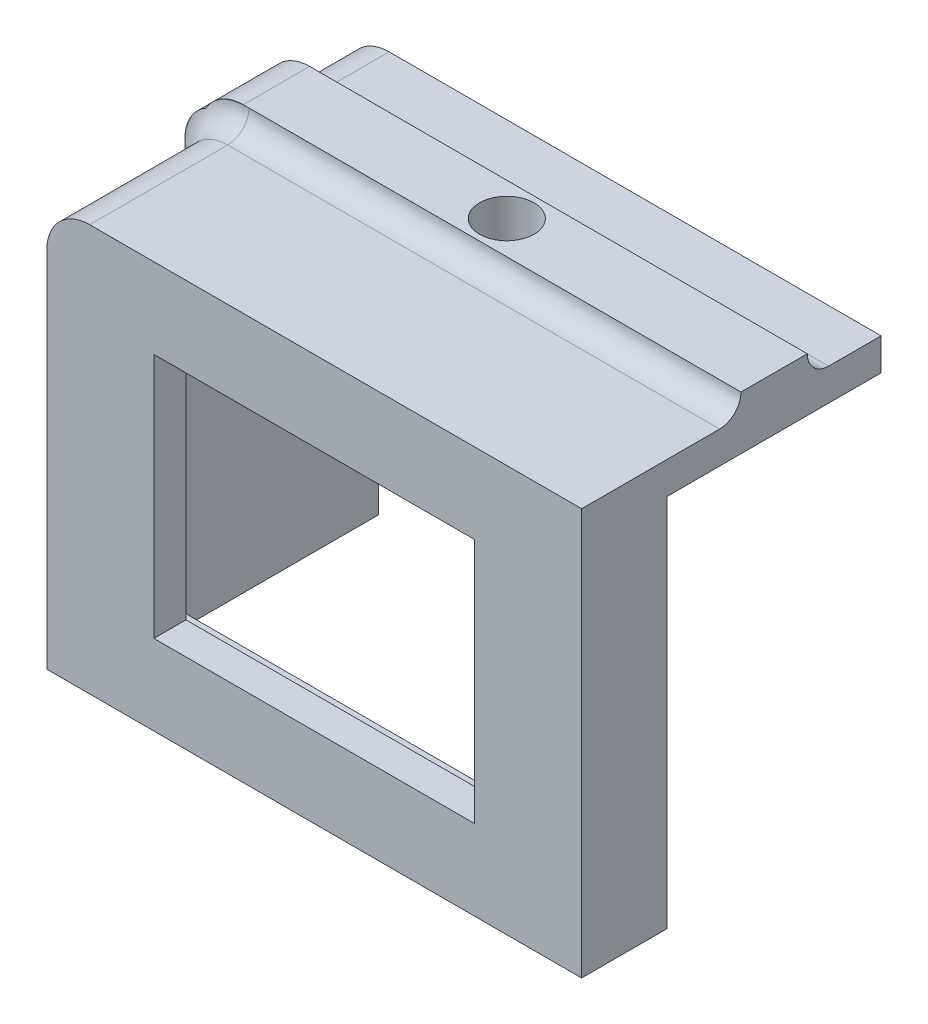
ISO-10303-21;
HEADER;
FILE_DESCRIPTION(('STEP AP214'),'2;1');
FILE_NAME('part.step','',(''),(''),'','','');
FILE_SCHEMA(('AUTOMOTIVE_DESIGN { 1 0 10303 214 1 1 1 1 }'));
ENDSEC;
DATA;
#1=APPLICATION_CONTEXT('core data for automotive mechanical design processes');
#2=APPLICATION_PROTOCOL_DEFINITION('international standard','automotive_design',2000,#1);
#3=PRODUCT_CONTEXT('',#1,'mechanical');
#4=PRODUCT('Part','Part','',(#3));
#5=PRODUCT_RELATED_PRODUCT_CATEGORY('part','',(#4));
#6=PRODUCT_DEFINITION_FORMATION('','',#4);
#7=PRODUCT_DEFINITION_CONTEXT('part definition',#1,'design');
#8=PRODUCT_DEFINITION('design','',#6,#7);
#9=PRODUCT_DEFINITION_SHAPE('','',#8);
#10=(LENGTH_UNIT() NAMED_UNIT(*) SI_UNIT(.MILLI.,.METRE.));
#11=(NAMED_UNIT(*) PLANE_ANGLE_UNIT() SI_UNIT($,.RADIAN.));
#12=(NAMED_UNIT(*) SI_UNIT($,.STERADIAN.) SOLID_ANGLE_UNIT());
#13=UNCERTAINTY_MEASURE_WITH_UNIT(LENGTH_MEASURE(1.E-05),#10,'distance_accuracy_value','');
#14=(GEOMETRIC_REPRESENTATION_CONTEXT(3) GLOBAL_UNCERTAINTY_ASSIGNED_CONTEXT((#13)) GLOBAL_UNIT_ASSIGNED_CONTEXT((#10,
#11,#12)) REPRESENTATION_CONTEXT('',''));
#15=CARTESIAN_POINT('',(0.,0.,0.));
#16=DIRECTION('',(0.,0.,1.));
#17=DIRECTION('',(1.,0.,0.));
#18=AXIS2_PLACEMENT_3D('',#15,#16,#17);
#19=CARTESIAN_POINT('',(25.,21.,-21.1));
#20=DIRECTION('',(0.,0.,1.));
#21=DIRECTION('',(1.,0.,0.));
#22=AXIS2_PLACEMENT_3D('',#19,#20,#21);
#23=PLANE('',#22);
#24=CARTESIAN_POINT('',(-21.,15.,-21.1));
#25=DIRECTION('',(0.,0.,1.));
#26=DIRECTION('',(1.,0.,0.));
#27=AXIS2_PLACEMENT_3D('',#24,#25,#26);
#28=CIRCLE('',#27,6.);
#29=CARTESIAN_POINT('',(-21.,21.,-21.1));
#30=VERTEX_POINT('',#29);
#31=CARTESIAN_POINT('',(-23.7408607599176,20.3373853425384,-21.1));
#32=VERTEX_POINT('',#31);
#33=EDGE_CURVE('E586',#30,#32,#28,.T.);
#34=ORIENTED_EDGE('',*,*,#33,.T.);
#35=CARTESIAN_POINT('',(-21.5358983848622,17.,-21.1));
#36=DIRECTION('',(0.,0.,1.));
#37=DIRECTION('',(1.,0.,0.));
#38=AXIS2_PLACEMENT_3D('',#35,#36,#37);
#39=CIRCLE('',#38,4.);
#40=CARTESIAN_POINT('',(-21.5358983848622,21.,-21.1));
#41=VERTEX_POINT('',#40);
#42=EDGE_CURVE('E352',#32,#41,#39,.F.);
#43=ORIENTED_EDGE('',*,*,#42,.T.);
#44=DIRECTION('',(-1.,0.,0.));
#45=VECTOR('',#44,1.);
#46=CARTESIAN_POINT('',(25.,21.,-21.1));
#47=LINE('',#46,#45);
#48=EDGE_CURVE('E259',#30,#41,#47,.T.);
#49=ORIENTED_EDGE('',*,*,#48,.F.);
#50=EDGE_LOOP('',(#34,#43,#49));
#51=FACE_BOUND('',#50,.T.);
#52=ADVANCED_FACE('F43',(#51),#23,.F.);
#53=CARTESIAN_POINT('',(-27.,19.,-14.9));
#54=DIRECTION('',(0.,0.,-1.));
#55=DIRECTION('',(0.,1.,0.));
#56=AXIS2_PLACEMENT_3D('',#53,#54,#55);
#57=PLANE('',#56);
#58=CARTESIAN_POINT('',(-21.,15.,-14.9));
#59=DIRECTION('',(0.,0.,-1.));
#60=DIRECTION('',(0.,1.,0.));
#61=AXIS2_PLACEMENT_3D('',#58,#59,#60);
#62=CIRCLE('',#61,6.);
#63=CARTESIAN_POINT('',(-27.,15.,-14.9));
#64=VERTEX_POINT('',#63);
#65=CARTESIAN_POINT('',(-26.3373853425384,17.7408607599176,-14.9));
#66=VERTEX_POINT('',#65);
#67=EDGE_CURVE('E571',#64,#66,#62,.T.);
#68=ORIENTED_EDGE('',*,*,#67,.T.);
#69=CARTESIAN_POINT('',(-23.,15.5358983848622,-14.9));
#70=DIRECTION('',(0.,0.,-1.));
#71=DIRECTION('',(0.,1.,0.));
#72=AXIS2_PLACEMENT_3D('',#69,#70,#71);
#73=CIRCLE('',#72,4.);
#74=CARTESIAN_POINT('',(-27.,15.5358983848622,-14.9));
#75=VERTEX_POINT('',#74);
#76=EDGE_CURVE('E11',#66,#75,#73,.F.);
#77=ORIENTED_EDGE('',*,*,#76,.T.);
#78=DIRECTION('',(0.,1.,0.));
#79=VECTOR('',#78,1.);
#80=CARTESIAN_POINT('',(-27.,19.,-14.9));
#81=LINE('',#80,#79);
#82=EDGE_CURVE('E380',#64,#75,#81,.T.);
#83=ORIENTED_EDGE('',*,*,#82,.F.);
#84=EDGE_LOOP('',(#68,#77,#83));
#85=FACE_BOUND('',#84,.T.);
#86=ADVANCED_FACE('F639',(#85),#57,.F.);
#87=CARTESIAN_POINT('',(0.,19.,-28.));
#88=DIRECTION('',(0.,-1.,0.));
#89=DIRECTION('',(0.,0.,-1.));
#90=AXIS2_PLACEMENT_3D('',#87,#88,#89);
#91=PLANE('',#90);
#92=DIRECTION('',(0.,0.,1.));
#93=VECTOR('',#92,1.);
#94=CARTESIAN_POINT('',(-21.,19.,-21.1));
#95=LINE('',#94,#93);
#96=CARTESIAN_POINT('',(-21.,19.,-28.));
#97=VERTEX_POINT('',#96);
#98=CARTESIAN_POINT('',(-21.,19.,-23.1));
#99=VERTEX_POINT('',#98);
#100=EDGE_CURVE('E559',#97,#99,#95,.T.);
#101=ORIENTED_EDGE('',*,*,#100,.T.);
#102=DIRECTION('',(-1.,0.,0.));
#103=VECTOR('',#102,1.);
#104=CARTESIAN_POINT('',(25.,19.,-23.1));
#105=LINE('',#104,#103);
#106=CARTESIAN_POINT('',(25.,19.,-23.1));
#107=VERTEX_POINT('',#106);
#108=EDGE_CURVE('E590',#99,#107,#105,.F.);
#109=ORIENTED_EDGE('',*,*,#108,.T.);
#110=DIRECTION('',(0.,0.,1.));
#111=VECTOR('',#110,1.);
#112=CARTESIAN_POINT('',(25.,19.,-28.));
#113=LINE('',#112,#111);
#114=CARTESIAN_POINT('',(25.,19.,-28.));
#115=VERTEX_POINT('',#114);
#116=EDGE_CURVE('E475',#115,#107,#113,.T.);
#117=ORIENTED_EDGE('',*,*,#116,.F.);
#118=DIRECTION('',(1.,0.,0.));
#119=VECTOR('',#118,1.);
#120=CARTESIAN_POINT('',(0.,19.,-28.));
#121=LINE('',#120,#119);
#122=EDGE_CURVE('E456',#97,#115,#121,.T.);
#123=ORIENTED_EDGE('',*,*,#122,.F.);
#124=EDGE_LOOP('',(#101,#109,#117,#123));
#125=FACE_BOUND('',#124,.T.);
#126=ADVANCED_FACE('F617',(#125),#91,.F.);
#127=CARTESIAN_POINT('',(-25.,0.,-28.));
#128=DIRECTION('',(-1.,0.,0.));
#129=DIRECTION('',(0.,0.,1.));
#130=AXIS2_PLACEMENT_3D('',#127,#128,#129);
#131=PLANE('',#130);
#132=DIRECTION('',(0.,0.,1.));
#133=VECTOR('',#132,1.);
#134=CARTESIAN_POINT('',(-25.,15.,-14.9));
#135=LINE('',#134,#133);
#136=CARTESIAN_POINT('',(-25.,15.,0.));
#137=VERTEX_POINT('',#136);
#138=CARTESIAN_POINT('',(-25.,15.,-12.9));
#139=VERTEX_POINT('',#138);
#140=EDGE_CURVE('E555',#137,#139,#135,.F.);
#141=ORIENTED_EDGE('',*,*,#140,.T.);
#142=DIRECTION('',(0.,1.,0.));
#143=VECTOR('',#142,1.);
#144=CARTESIAN_POINT('',(-25.,0.,-12.9));
#145=LINE('',#144,#143);
#146=CARTESIAN_POINT('',(-25.,-19.,-12.9));
#147=VERTEX_POINT('',#146);
#148=EDGE_CURVE('E574',#139,#147,#145,.F.);
#149=ORIENTED_EDGE('',*,*,#148,.T.);
#150=DIRECTION('',(0.,0.,1.));
#151=VECTOR('',#150,1.);
#152=CARTESIAN_POINT('',(-25.,-19.,-28.));
#153=LINE('',#152,#151);
#154=CARTESIAN_POINT('',(-25.,-19.,0.));
#155=VERTEX_POINT('',#154);
#156=EDGE_CURVE('E478',#147,#155,#153,.T.);
#157=ORIENTED_EDGE('',*,*,#156,.T.);
#158=DIRECTION('',(0.,-1.,0.));
#159=VECTOR('',#158,1.);
#160=CARTESIAN_POINT('',(-25.,0.,0.));
#161=LINE('',#160,#159);
#162=EDGE_CURVE('E442',#137,#155,#161,.T.);
#163=ORIENTED_EDGE('',*,*,#162,.F.);
#164=EDGE_LOOP('',(#141,#149,#157,#163));
#165=FACE_BOUND('',#164,.T.);
#166=ADVANCED_FACE('F723',(#165),#131,.T.);
#167=CARTESIAN_POINT('',(-22.,0.,-28.));
#168=DIRECTION('',(-1.,0.,0.));
#169=DIRECTION('',(0.,-1.,0.));
#170=AXIS2_PLACEMENT_3D('',#167,#168,#169);
#171=PLANE('',#170);
#172=CARTESIAN_POINT('',(-22.,0.,-18.));
#173=DIRECTION('',(-1.,0.,0.));
#174=DIRECTION('',(0.,-1.,0.));
#175=AXIS2_PLACEMENT_3D('',#172,#173,#174);
#176=CIRCLE('',#175,2.55);
#177=CARTESIAN_POINT('',(-22.,-2.55,-18.));
#178=VERTEX_POINT('',#177);
#179=EDGE_CURVE('E395',#178,#178,#176,.T.);
#180=ORIENTED_EDGE('',*,*,#179,.T.);
#181=EDGE_LOOP('',(#180));
#182=FACE_BOUND('',#181,.T.);
#183=DIRECTION('',(0.,0.,1.));
#184=VECTOR('',#183,1.);
#185=CARTESIAN_POINT('',(-22.,-16.,-8.));
#186=LINE('',#185,#184);
#187=CARTESIAN_POINT('',(-22.,-16.,-8.));
#188=VERTEX_POINT('',#187);
#189=CARTESIAN_POINT('',(-22.,-16.,-3.));
#190=VERTEX_POINT('',#189);
#191=EDGE_CURVE('E427',#188,#190,#186,.T.);
#192=ORIENTED_EDGE('',*,*,#191,.F.);
#193=DIRECTION('',(0.,-1.,0.));
#194=VECTOR('',#193,1.);
#195=CARTESIAN_POINT('',(-22.,0.,-8.));
#196=LINE('',#195,#194);
#197=CARTESIAN_POINT('',(-22.,-19.,-8.));
#198=VERTEX_POINT('',#197);
#199=EDGE_CURVE('E410',#188,#198,#196,.T.);
#200=ORIENTED_EDGE('',*,*,#199,.T.);
#201=DIRECTION('',(0.,0.,1.));
#202=VECTOR('',#201,1.);
#203=CARTESIAN_POINT('',(-22.,-19.,-28.));
#204=LINE('',#203,#202);
#205=CARTESIAN_POINT('',(-22.,-19.,-28.));
#206=VERTEX_POINT('',#205);
#207=EDGE_CURVE('E484',#206,#198,#204,.T.);
#208=ORIENTED_EDGE('',*,*,#207,.F.);
#209=DIRECTION('',(0.,-1.,0.));
#210=VECTOR('',#209,1.);
#211=CARTESIAN_POINT('',(-22.,0.,-28.));
#212=LINE('',#211,#210);
#213=CARTESIAN_POINT('',(-22.,16.,-28.));
#214=VERTEX_POINT('',#213);
#215=EDGE_CURVE('E466',#214,#206,#212,.T.);
#216=ORIENTED_EDGE('',*,*,#215,.F.);
#217=DIRECTION('',(0.,0.,1.));
#218=VECTOR('',#217,1.);
#219=CARTESIAN_POINT('',(-22.,16.,-28.));
#220=LINE('',#219,#218);
#221=CARTESIAN_POINT('',(-22.,16.,-3.));
#222=VERTEX_POINT('',#221);
#223=EDGE_CURVE('E487',#214,#222,#220,.T.);
#224=ORIENTED_EDGE('',*,*,#223,.T.);
#225=DIRECTION('',(0.,-1.,0.));
#226=VECTOR('',#225,1.);
#227=CARTESIAN_POINT('',(-22.,0.,-3.));
#228=LINE('',#227,#226);
#229=EDGE_CURVE('E514',#222,#190,#228,.T.);
#230=ORIENTED_EDGE('',*,*,#229,.T.);
#231=EDGE_LOOP('',(#192,#200,#208,#216,#224,#230));
#232=FACE_BOUND('',#231,.T.);
#233=ADVANCED_FACE('F705',(#182,#232),#171,.F.);
#234=CARTESIAN_POINT('',(0.,11.5,-3.));
#235=DIRECTION('',(0.,-1.,0.));
#236=DIRECTION('',(0.,0.,-1.));
#237=AXIS2_PLACEMENT_3D('',#234,#235,#236);
#238=PLANE('',#237);
#239=DIRECTION('',(1.,0.,0.));
#240=VECTOR('',#239,1.);
#241=CARTESIAN_POINT('',(0.,11.5,0.));
#242=LINE('',#241,#240);
#243=CARTESIAN_POINT('',(-15.,11.5,0.));
#244=VERTEX_POINT('',#243);
#245=CARTESIAN_POINT('',(15.,11.5,0.));
#246=VERTEX_POINT('',#245);
#247=EDGE_CURVE('E491',#244,#246,#242,.T.);
#248=ORIENTED_EDGE('',*,*,#247,.F.);
#249=DIRECTION('',(0.,0.,1.));
#250=VECTOR('',#249,1.);
#251=CARTESIAN_POINT('',(-15.,11.5,-3.));
#252=LINE('',#251,#250);
#253=CARTESIAN_POINT('',(-15.,11.5,-3.));
#254=VERTEX_POINT('',#253);
#255=EDGE_CURVE('E546',#254,#244,#252,.T.);
#256=ORIENTED_EDGE('',*,*,#255,.F.);
#257=DIRECTION('',(1.,0.,0.));
#258=VECTOR('',#257,1.);
#259=CARTESIAN_POINT('',(0.,11.5,-3.));
#260=LINE('',#259,#258);
#261=CARTESIAN_POINT('',(15.,11.5,-3.));
#262=VERTEX_POINT('',#261);
#263=EDGE_CURVE('E521',#254,#262,#260,.T.);
#264=ORIENTED_EDGE('',*,*,#263,.T.);
#265=DIRECTION('',(0.,0.,1.));
#266=VECTOR('',#265,1.);
#267=CARTESIAN_POINT('',(15.,11.5,-3.));
#268=LINE('',#267,#266);
#269=EDGE_CURVE('E536',#262,#246,#268,.T.);
#270=ORIENTED_EDGE('',*,*,#269,.T.);
#271=EDGE_LOOP('',(#248,#256,#264,#270));
#272=FACE_BOUND('',#271,.T.);
#273=ADVANCED_FACE('F730',(#272),#238,.T.);
#274=CARTESIAN_POINT('',(-15.,0.,-3.));
#275=DIRECTION('',(-1.,0.,0.));
#276=DIRECTION('',(0.,0.,1.));
#277=AXIS2_PLACEMENT_3D('',#274,#275,#276);
#278=PLANE('',#277);
#279=DIRECTION('',(0.,-1.,0.));
#280=VECTOR('',#279,1.);
#281=CARTESIAN_POINT('',(-15.,0.,0.));
#282=LINE('',#281,#280);
#283=CARTESIAN_POINT('',(-15.,-11.5,0.));
#284=VERTEX_POINT('',#283);
#285=EDGE_CURVE('E503',#244,#284,#282,.T.);
#286=ORIENTED_EDGE('',*,*,#285,.T.);
#287=DIRECTION('',(0.,0.,1.));
#288=VECTOR('',#287,1.);
#289=CARTESIAN_POINT('',(-15.,-11.5,-3.));
#290=LINE('',#289,#288);
#291=CARTESIAN_POINT('',(-15.,-11.5,-3.));
#292=VERTEX_POINT('',#291);
#293=EDGE_CURVE('E542',#292,#284,#290,.T.);
#294=ORIENTED_EDGE('',*,*,#293,.F.);
#295=DIRECTION('',(0.,-1.,0.));
#296=VECTOR('',#295,1.);
#297=CARTESIAN_POINT('',(-15.,0.,-3.));
#298=LINE('',#297,#296);
#299=EDGE_CURVE('E532',#254,#292,#298,.T.);
#300=ORIENTED_EDGE('',*,*,#299,.F.);
#301=ORIENTED_EDGE('',*,*,#255,.T.);
#302=EDGE_LOOP('',(#286,#294,#300,#301));
#303=FACE_BOUND('',#302,.T.);
#304=ADVANCED_FACE('F971',(#303),#278,.F.);
#305=CARTESIAN_POINT('',(0.,-11.5,-3.));
#306=DIRECTION('',(0.,-1.,0.));
#307=DIRECTION('',(0.,0.,-1.));
#308=AXIS2_PLACEMENT_3D('',#305,#306,#307);
#309=PLANE('',#308);
#310=DIRECTION('',(1.,0.,0.));
#311=VECTOR('',#310,1.);
#312=CARTESIAN_POINT('',(0.,-11.5,0.));
#313=LINE('',#312,#311);
#314=CARTESIAN_POINT('',(15.,-11.5,0.));
#315=VERTEX_POINT('',#314);
#316=EDGE_CURVE('E499',#284,#315,#313,.T.);
#317=ORIENTED_EDGE('',*,*,#316,.T.);
#318=DIRECTION('',(0.,0.,1.));
#319=VECTOR('',#318,1.);
#320=CARTESIAN_POINT('',(15.,-11.5,-3.));
#321=LINE('',#320,#319);
#322=CARTESIAN_POINT('',(15.,-11.5,-3.));
#323=VERTEX_POINT('',#322);
#324=EDGE_CURVE('E539',#323,#315,#321,.T.);
#325=ORIENTED_EDGE('',*,*,#324,.F.);
#326=DIRECTION('',(1.,0.,0.));
#327=VECTOR('',#326,1.);
#328=CARTESIAN_POINT('',(0.,-11.5,-3.));
#329=LINE('',#328,#327);
#330=EDGE_CURVE('E529',#292,#323,#329,.T.);
#331=ORIENTED_EDGE('',*,*,#330,.F.);
#332=ORIENTED_EDGE('',*,*,#293,.T.);
#333=EDGE_LOOP('',(#317,#325,#331,#332));
#334=FACE_BOUND('',#333,.T.);
#335=ADVANCED_FACE('F979',(#334),#309,.F.);
#336=CARTESIAN_POINT('',(15.,0.,-3.));
#337=DIRECTION('',(-1.,0.,0.));
#338=DIRECTION('',(0.,0.,1.));
#339=AXIS2_PLACEMENT_3D('',#336,#337,#338);
#340=PLANE('',#339);
#341=DIRECTION('',(0.,-1.,0.));
#342=VECTOR('',#341,1.);
#343=CARTESIAN_POINT('',(15.,0.,0.));
#344=LINE('',#343,#342);
#345=EDGE_CURVE('E495',#246,#315,#344,.T.);
#346=ORIENTED_EDGE('',*,*,#345,.F.);
#347=ORIENTED_EDGE('',*,*,#269,.F.);
#348=DIRECTION('',(0.,-1.,0.));
#349=VECTOR('',#348,1.);
#350=CARTESIAN_POINT('',(15.,0.,-3.));
#351=LINE('',#350,#349);
#352=EDGE_CURVE('E525',#262,#323,#351,.T.);
#353=ORIENTED_EDGE('',*,*,#352,.T.);
#354=ORIENTED_EDGE('',*,*,#324,.T.);
#355=EDGE_LOOP('',(#346,#347,#353,#354));
#356=FACE_BOUND('',#355,.T.);
#357=ADVANCED_FACE('F987',(#356),#340,.T.);
#358=CARTESIAN_POINT('',(0.,0.,-3.));
#359=DIRECTION('',(0.,0.,1.));
#360=DIRECTION('',(1.,0.,0.));
#361=AXIS2_PLACEMENT_3D('',#358,#359,#360);
#362=PLANE('',#361);
#363=DIRECTION('',(0.,-1.,0.));
#364=VECTOR('',#363,1.);
#365=CARTESIAN_POINT('',(22.,0.,-3.));
#366=LINE('',#365,#364);
#367=CARTESIAN_POINT('',(22.,16.,-3.));
#368=VERTEX_POINT('',#367);
#369=CARTESIAN_POINT('',(22.,-16.,-3.));
#370=VERTEX_POINT('',#369);
#371=EDGE_CURVE('E507',#368,#370,#366,.T.);
#372=ORIENTED_EDGE('',*,*,#371,.T.);
#373=DIRECTION('',(1.,0.,0.));
#374=VECTOR('',#373,1.);
#375=CARTESIAN_POINT('',(0.,-16.,-3.));
#376=LINE('',#375,#374);
#377=EDGE_CURVE('E517',#190,#370,#376,.T.);
#378=ORIENTED_EDGE('',*,*,#377,.F.);
#379=ORIENTED_EDGE('',*,*,#229,.F.);
#380=DIRECTION('',(1.,0.,0.));
#381=VECTOR('',#380,1.);
#382=CARTESIAN_POINT('',(0.,16.,-3.));
#383=LINE('',#382,#381);
#384=EDGE_CURVE('E510',#222,#368,#383,.T.);
#385=ORIENTED_EDGE('',*,*,#384,.T.);
#386=EDGE_LOOP('',(#372,#378,#379,#385));
#387=FACE_BOUND('',#386,.T.);
#388=ORIENTED_EDGE('',*,*,#263,.F.);
#389=ORIENTED_EDGE('',*,*,#299,.T.);
#390=ORIENTED_EDGE('',*,*,#330,.T.);
#391=ORIENTED_EDGE('',*,*,#352,.F.);
#392=EDGE_LOOP('',(#388,#389,#390,#391));
#393=FACE_BOUND('',#392,.T.);
#394=ADVANCED_FACE('F695',(#387,#393),#362,.F.);
#395=CARTESIAN_POINT('',(0.,0.,0.));
#396=DIRECTION('',(0.,0.,1.));
#397=DIRECTION('',(1.,0.,0.));
#398=AXIS2_PLACEMENT_3D('',#395,#396,#397);
#399=PLANE('',#398);
#400=DIRECTION('',(1.,0.,0.));
#401=VECTOR('',#400,1.);
#402=CARTESIAN_POINT('',(0.,19.,0.));
#403=LINE('',#402,#401);
#404=CARTESIAN_POINT('',(-21.,19.,0.));
#405=VERTEX_POINT('',#404);
#406=CARTESIAN_POINT('',(25.,19.,0.));
#407=VERTEX_POINT('',#406);
#408=EDGE_CURVE('E438',#405,#407,#403,.T.);
#409=ORIENTED_EDGE('',*,*,#408,.F.);
#410=CARTESIAN_POINT('',(-21.,15.,0.));
#411=DIRECTION('',(0.,0.,1.));
#412=DIRECTION('',(1.,0.,0.));
#413=AXIS2_PLACEMENT_3D('',#410,#411,#412);
#414=CIRCLE('',#413,4.);
#415=EDGE_CURVE('E552',#405,#137,#414,.T.);
#416=ORIENTED_EDGE('',*,*,#415,.T.);
#417=ORIENTED_EDGE('',*,*,#162,.T.);
#418=DIRECTION('',(1.,0.,0.));
#419=VECTOR('',#418,1.);
#420=CARTESIAN_POINT('',(0.,-19.,0.));
#421=LINE('',#420,#419);
#422=CARTESIAN_POINT('',(25.,-19.,0.));
#423=VERTEX_POINT('',#422);
#424=EDGE_CURVE('E446',#155,#423,#421,.T.);
#425=ORIENTED_EDGE('',*,*,#424,.T.);
#426=DIRECTION('',(0.,-1.,0.));
#427=VECTOR('',#426,1.);
#428=CARTESIAN_POINT('',(25.,0.,0.));
#429=LINE('',#428,#427);
#430=EDGE_CURVE('E435',#407,#423,#429,.T.);
#431=ORIENTED_EDGE('',*,*,#430,.F.);
#432=EDGE_LOOP('',(#409,#416,#417,#425,#431));
#433=FACE_BOUND('',#432,.T.);
#434=ORIENTED_EDGE('',*,*,#247,.T.);
#435=ORIENTED_EDGE('',*,*,#345,.T.);
#436=ORIENTED_EDGE('',*,*,#316,.F.);
#437=ORIENTED_EDGE('',*,*,#285,.F.);
#438=EDGE_LOOP('',(#434,#435,#436,#437));
#439=FACE_BOUND('',#438,.T.);
#440=ADVANCED_FACE('F687',(#433,#439),#399,.T.);
#441=CARTESIAN_POINT('',(0.,16.,-28.));
#442=DIRECTION('',(0.,-1.,0.));
#443=DIRECTION('',(0.,0.,-1.));
#444=AXIS2_PLACEMENT_3D('',#441,#442,#443);
#445=PLANE('',#444);
#446=CARTESIAN_POINT('',(0.,16.,-18.));
#447=DIRECTION('',(0.,-1.,0.));
#448=DIRECTION('',(0.,0.,-1.));
#449=AXIS2_PLACEMENT_3D('',#446,#447,#448);
#450=CIRCLE('',#449,2.55);
#451=CARTESIAN_POINT('',(0.,16.,-20.55));
#452=VERTEX_POINT('',#451);
#453=EDGE_CURVE('E285',#452,#452,#450,.T.);
#454=ORIENTED_EDGE('',*,*,#453,.F.);
#455=EDGE_LOOP('',(#454));
#456=FACE_BOUND('',#455,.T.);
#457=DIRECTION('',(0.,0.,1.));
#458=VECTOR('',#457,1.);
#459=CARTESIAN_POINT('',(22.,16.,-8.));
#460=LINE('',#459,#458);
#461=CARTESIAN_POINT('',(22.,16.,-8.));
#462=VERTEX_POINT('',#461);
#463=EDGE_CURVE('E420',#462,#368,#460,.T.);
#464=ORIENTED_EDGE('',*,*,#463,.T.);
#465=ORIENTED_EDGE('',*,*,#384,.F.);
#466=ORIENTED_EDGE('',*,*,#223,.F.);
#467=DIRECTION('',(1.,0.,0.));
#468=VECTOR('',#467,1.);
#469=CARTESIAN_POINT('',(0.,16.,-28.));
#470=LINE('',#469,#468);
#471=CARTESIAN_POINT('',(25.,16.,-28.));
#472=VERTEX_POINT('',#471);
#473=EDGE_CURVE('E449',#214,#472,#470,.T.);
#474=ORIENTED_EDGE('',*,*,#473,.T.);
#475=DIRECTION('',(0.,0.,1.));
#476=VECTOR('',#475,1.);
#477=CARTESIAN_POINT('',(25.,16.,-28.));
#478=LINE('',#477,#476);
#479=CARTESIAN_POINT('',(25.,16.,-8.));
#480=VERTEX_POINT('',#479);
#481=EDGE_CURVE('E469',#472,#480,#478,.T.);
#482=ORIENTED_EDGE('',*,*,#481,.T.);
#483=DIRECTION('',(1.,0.,0.));
#484=VECTOR('',#483,1.);
#485=CARTESIAN_POINT('',(0.,16.,-8.));
#486=LINE('',#485,#484);
#487=EDGE_CURVE('E399',#462,#480,#486,.T.);
#488=ORIENTED_EDGE('',*,*,#487,.F.);
#489=EDGE_LOOP('',(#464,#465,#466,#474,#482,#488));
#490=FACE_BOUND('',#489,.T.);
#491=ADVANCED_FACE('F684',(#456,#490),#445,.T.);
#492=CARTESIAN_POINT('',(0.,-19.,-28.));
#493=DIRECTION('',(0.,-1.,0.));
#494=DIRECTION('',(0.,0.,-1.));
#495=AXIS2_PLACEMENT_3D('',#492,#493,#494);
#496=PLANE('',#495);
#497=ORIENTED_EDGE('',*,*,#424,.F.);
#498=ORIENTED_EDGE('',*,*,#156,.F.);
#499=CARTESIAN_POINT('',(-27.,-19.,-12.9));
#500=DIRECTION('',(0.,-1.,0.));
#501=DIRECTION('',(0.,0.,-1.));
#502=AXIS2_PLACEMENT_3D('',#499,#500,#501);
#503=CIRCLE('',#502,2.);
#504=CARTESIAN_POINT('',(-27.,-19.,-14.9));
#505=VERTEX_POINT('',#504);
#506=EDGE_CURVE('E265',#147,#505,#503,.F.);
#507=ORIENTED_EDGE('',*,*,#506,.T.);
#508=DIRECTION('',(0.,0.,1.));
#509=VECTOR('',#508,1.);
#510=CARTESIAN_POINT('',(-27.,-19.,-21.1));
#511=LINE('',#510,#509);
#512=CARTESIAN_POINT('',(-27.,-19.,-21.1));
#513=VERTEX_POINT('',#512);
#514=EDGE_CURVE('E392',#513,#505,#511,.T.);
#515=ORIENTED_EDGE('',*,*,#514,.F.);
#516=CARTESIAN_POINT('',(-27.,-19.,-23.1));
#517=DIRECTION('',(0.,-1.,0.));
#518=DIRECTION('',(0.,0.,-1.));
#519=AXIS2_PLACEMENT_3D('',#516,#517,#518);
#520=CIRCLE('',#519,2.);
#521=CARTESIAN_POINT('',(-25.,-19.,-23.1));
#522=VERTEX_POINT('',#521);
#523=EDGE_CURVE('E269',#513,#522,#520,.F.);
#524=ORIENTED_EDGE('',*,*,#523,.T.);
#525=CARTESIAN_POINT('',(-25.,-19.,-28.));
#526=VERTEX_POINT('',#525);
#527=EDGE_CURVE('E480',#526,#522,#153,.T.);
#528=ORIENTED_EDGE('',*,*,#527,.F.);
#529=DIRECTION('',(1.,0.,0.));
#530=VECTOR('',#529,1.);
#531=CARTESIAN_POINT('',(0.,-19.,-28.));
#532=LINE('',#531,#530);
#533=EDGE_CURVE('E462',#526,#206,#532,.T.);
#534=ORIENTED_EDGE('',*,*,#533,.T.);
#535=ORIENTED_EDGE('',*,*,#207,.T.);
#536=DIRECTION('',(1.,0.,0.));
#537=VECTOR('',#536,1.);
#538=CARTESIAN_POINT('',(0.,-19.,-8.));
#539=LINE('',#538,#537);
#540=CARTESIAN_POINT('',(25.,-19.,-8.));
#541=VERTEX_POINT('',#540);
#542=EDGE_CURVE('E413',#198,#541,#539,.T.);
#543=ORIENTED_EDGE('',*,*,#542,.T.);
#544=DIRECTION('',(0.,0.,1.));
#545=VECTOR('',#544,1.);
#546=CARTESIAN_POINT('',(25.,-19.,-8.));
#547=LINE('',#546,#545);
#548=EDGE_CURVE('E431',#541,#423,#547,.T.);
#549=ORIENTED_EDGE('',*,*,#548,.T.);
#550=EDGE_LOOP('',(#497,#498,#507,#515,#524,#528,#534,#535,#543,#549));
#551=FACE_BOUND('',#550,.T.);
#552=ADVANCED_FACE('F628',(#551),#496,.T.);
#553=ORIENTED_EDGE('',*,*,#527,.T.);
#554=DIRECTION('',(0.,-1.,0.));
#555=VECTOR('',#554,1.);
#556=CARTESIAN_POINT('',(-25.,0.,-23.1));
#557=LINE('',#556,#555);
#558=CARTESIAN_POINT('',(-25.,15.,-23.1));
#559=VERTEX_POINT('',#558);
#560=EDGE_CURVE('E271',#522,#559,#557,.F.);
#561=ORIENTED_EDGE('',*,*,#560,.T.);
#562=DIRECTION('',(0.,0.,1.));
#563=VECTOR('',#562,1.);
#564=CARTESIAN_POINT('',(-25.,15.,-28.));
#565=LINE('',#564,#563);
#566=CARTESIAN_POINT('',(-25.,15.,-28.));
#567=VERTEX_POINT('',#566);
#568=EDGE_CURVE('E563',#559,#567,#565,.F.);
#569=ORIENTED_EDGE('',*,*,#568,.T.);
#570=DIRECTION('',(0.,-1.,0.));
#571=VECTOR('',#570,1.);
#572=CARTESIAN_POINT('',(-25.,0.,-28.));
#573=LINE('',#572,#571);
#574=EDGE_CURVE('E459',#567,#526,#573,.T.);
#575=ORIENTED_EDGE('',*,*,#574,.T.);
#576=EDGE_LOOP('',(#553,#561,#569,#575));
#577=FACE_BOUND('',#576,.T.);
#578=ADVANCED_FACE('F600',(#577),#131,.T.);
#579=CARTESIAN_POINT('',(25.,19.,-12.9));
#580=VERTEX_POINT('',#579);
#581=EDGE_CURVE('E472',#580,#407,#113,.T.);
#582=ORIENTED_EDGE('',*,*,#581,.F.);
#583=DIRECTION('',(1.,0.,0.));
#584=VECTOR('',#583,1.);
#585=CARTESIAN_POINT('',(-21.,19.,-12.9));
#586=LINE('',#585,#584);
#587=CARTESIAN_POINT('',(-21.,19.,-12.9));
#588=VERTEX_POINT('',#587);
#589=EDGE_CURVE('E263',#580,#588,#586,.F.);
#590=ORIENTED_EDGE('',*,*,#589,.T.);
#591=DIRECTION('',(0.,0.,1.));
#592=VECTOR('',#591,1.);
#593=CARTESIAN_POINT('',(-21.,19.,0.));
#594=LINE('',#593,#592);
#595=EDGE_CURVE('E549',#588,#405,#594,.T.);
#596=ORIENTED_EDGE('',*,*,#595,.T.);
#597=ORIENTED_EDGE('',*,*,#408,.T.);
#598=EDGE_LOOP('',(#582,#590,#596,#597));
#599=FACE_BOUND('',#598,.T.);
#600=ADVANCED_FACE('F718',(#599),#91,.F.);
#601=CARTESIAN_POINT('',(25.,0.,-28.));
#602=DIRECTION('',(-1.,0.,0.));
#603=DIRECTION('',(0.,0.,1.));
#604=AXIS2_PLACEMENT_3D('',#601,#602,#603);
#605=PLANE('',#604);
#606=ORIENTED_EDGE('',*,*,#430,.T.);
#607=ORIENTED_EDGE('',*,*,#548,.F.);
#608=DIRECTION('',(0.,-1.,0.));
#609=VECTOR('',#608,1.);
#610=CARTESIAN_POINT('',(25.,0.,-8.));
#611=LINE('',#610,#609);
#612=EDGE_CURVE('E417',#480,#541,#611,.T.);
#613=ORIENTED_EDGE('',*,*,#612,.F.);
#614=ORIENTED_EDGE('',*,*,#481,.F.);
#615=DIRECTION('',(0.,-1.,0.));
#616=VECTOR('',#615,1.);
#617=CARTESIAN_POINT('',(25.,0.,-28.));
#618=LINE('',#617,#616);
#619=EDGE_CURVE('E453',#115,#472,#618,.T.);
#620=ORIENTED_EDGE('',*,*,#619,.F.);
#621=ORIENTED_EDGE('',*,*,#116,.T.);
#622=CARTESIAN_POINT('',(25.,21.,-23.1));
#623=DIRECTION('',(-1.,0.,0.));
#624=DIRECTION('',(0.,0.,1.));
#625=AXIS2_PLACEMENT_3D('',#622,#623,#624);
#626=CIRCLE('',#625,2.);
#627=CARTESIAN_POINT('',(25.,21.,-21.1));
#628=VERTEX_POINT('',#627);
#629=EDGE_CURVE('E257',#107,#628,#626,.T.);
#630=ORIENTED_EDGE('',*,*,#629,.T.);
#631=DIRECTION('',(0.,0.,-1.));
#632=VECTOR('',#631,1.);
#633=CARTESIAN_POINT('',(25.,21.,-21.1));
#634=LINE('',#633,#632);
#635=CARTESIAN_POINT('',(25.,21.,-14.9));
#636=VERTEX_POINT('',#635);
#637=EDGE_CURVE('E238',#636,#628,#634,.T.);
#638=ORIENTED_EDGE('',*,*,#637,.F.);
#639=CARTESIAN_POINT('',(25.,21.,-12.9));
#640=DIRECTION('',(-1.,0.,0.));
#641=DIRECTION('',(0.,0.,1.));
#642=AXIS2_PLACEMENT_3D('',#639,#640,#641);
#643=CIRCLE('',#642,2.);
#644=EDGE_CURVE('E253',#636,#580,#643,.T.);
#645=ORIENTED_EDGE('',*,*,#644,.T.);
#646=ORIENTED_EDGE('',*,*,#581,.T.);
#647=EDGE_LOOP('',(#606,#607,#613,#614,#620,#621,#630,#638,#645,#646));
#648=FACE_BOUND('',#647,.T.);
#649=ADVANCED_FACE('F252',(#648),#605,.F.);
#650=CARTESIAN_POINT('',(0.,0.,-28.));
#651=DIRECTION('',(0.,0.,1.));
#652=DIRECTION('',(1.,0.,0.));
#653=AXIS2_PLACEMENT_3D('',#650,#651,#652);
#654=PLANE('',#653);
#655=ORIENTED_EDGE('',*,*,#574,.F.);
#656=CARTESIAN_POINT('',(-21.,15.,-28.));
#657=DIRECTION('',(0.,0.,1.));
#658=DIRECTION('',(1.,0.,0.));
#659=AXIS2_PLACEMENT_3D('',#656,#657,#658);
#660=CIRCLE('',#659,4.);
#661=EDGE_CURVE('E566',#567,#97,#660,.F.);
#662=ORIENTED_EDGE('',*,*,#661,.T.);
#663=ORIENTED_EDGE('',*,*,#122,.T.);
#664=ORIENTED_EDGE('',*,*,#619,.T.);
#665=ORIENTED_EDGE('',*,*,#473,.F.);
#666=ORIENTED_EDGE('',*,*,#215,.T.);
#667=ORIENTED_EDGE('',*,*,#533,.F.);
#668=EDGE_LOOP('',(#655,#662,#663,#664,#665,#666,#667));
#669=FACE_BOUND('',#668,.T.);
#670=ADVANCED_FACE('F624',(#669),#654,.F.);
#671=CARTESIAN_POINT('',(22.,0.,-8.));
#672=DIRECTION('',(-1.,0.,0.));
#673=DIRECTION('',(0.,-1.,0.));
#674=AXIS2_PLACEMENT_3D('',#671,#672,#673);
#675=PLANE('',#674);
#676=ORIENTED_EDGE('',*,*,#371,.F.);
#677=ORIENTED_EDGE('',*,*,#463,.F.);
#678=DIRECTION('',(0.,-1.,0.));
#679=VECTOR('',#678,1.);
#680=CARTESIAN_POINT('',(22.,0.,-8.));
#681=LINE('',#680,#679);
#682=CARTESIAN_POINT('',(22.,-16.,-8.));
#683=VERTEX_POINT('',#682);
#684=EDGE_CURVE('E403',#462,#683,#681,.T.);
#685=ORIENTED_EDGE('',*,*,#684,.T.);
#686=DIRECTION('',(0.,0.,1.));
#687=VECTOR('',#686,1.);
#688=CARTESIAN_POINT('',(22.,-16.,-8.));
#689=LINE('',#688,#687);
#690=EDGE_CURVE('E423',#683,#370,#689,.T.);
#691=ORIENTED_EDGE('',*,*,#690,.T.);
#692=EDGE_LOOP('',(#676,#677,#685,#691));
#693=FACE_BOUND('',#692,.T.);
#694=ADVANCED_FACE('F698',(#693),#675,.T.);
#695=CARTESIAN_POINT('',(0.,-16.,-8.));
#696=DIRECTION('',(0.,-1.,0.));
#697=DIRECTION('',(1.,0.,0.));
#698=AXIS2_PLACEMENT_3D('',#695,#696,#697);
#699=PLANE('',#698);
#700=ORIENTED_EDGE('',*,*,#191,.T.);
#701=ORIENTED_EDGE('',*,*,#377,.T.);
#702=ORIENTED_EDGE('',*,*,#690,.F.);
#703=DIRECTION('',(1.,0.,0.));
#704=VECTOR('',#703,1.);
#705=CARTESIAN_POINT('',(0.,-16.,-8.));
#706=LINE('',#705,#704);
#707=EDGE_CURVE('E407',#188,#683,#706,.T.);
#708=ORIENTED_EDGE('',*,*,#707,.F.);
#709=EDGE_LOOP('',(#700,#701,#702,#708));
#710=FACE_BOUND('',#709,.T.);
#711=ADVANCED_FACE('F702',(#710),#699,.F.);
#712=CARTESIAN_POINT('',(0.,0.,-8.));
#713=DIRECTION('',(0.,0.,1.));
#714=DIRECTION('',(1.,0.,0.));
#715=AXIS2_PLACEMENT_3D('',#712,#713,#714);
#716=PLANE('',#715);
#717=ORIENTED_EDGE('',*,*,#487,.T.);
#718=ORIENTED_EDGE('',*,*,#612,.T.);
#719=ORIENTED_EDGE('',*,*,#542,.F.);
#720=ORIENTED_EDGE('',*,*,#199,.F.);
#721=ORIENTED_EDGE('',*,*,#707,.T.);
#722=ORIENTED_EDGE('',*,*,#684,.F.);
#723=EDGE_LOOP('',(#717,#718,#719,#720,#721,#722));
#724=FACE_BOUND('',#723,.T.);
#725=ADVANCED_FACE('F711',(#724),#716,.F.);
#726=CARTESIAN_POINT('',(25.,0.,-18.));
#727=DIRECTION('',(-1.,0.,0.));
#728=DIRECTION('',(0.,0.,1.));
#729=AXIS2_PLACEMENT_3D('',#726,#727,#728);
#730=CYLINDRICAL_SURFACE('',#729,2.55);
#731=ORIENTED_EDGE('',*,*,#179,.F.);
#732=EDGE_LOOP('',(#731));
#733=FACE_BOUND('',#732,.T.);
#734=CARTESIAN_POINT('',(-27.,0.,-18.));
#735=DIRECTION('',(-1.,0.,0.));
#736=DIRECTION('',(0.,0.,1.));
#737=AXIS2_PLACEMENT_3D('',#734,#735,#736);
#738=CIRCLE('',#737,2.55);
#739=CARTESIAN_POINT('',(-27.,0.,-15.45));
#740=VERTEX_POINT('',#739);
#741=EDGE_CURVE('E377',#740,#740,#738,.T.);
#742=ORIENTED_EDGE('',*,*,#741,.T.);
#743=EDGE_LOOP('',(#742));
#744=FACE_BOUND('',#743,.T.);
#745=ADVANCED_FACE('F658',(#733,#744),#730,.F.);
#746=CARTESIAN_POINT('',(-27.,0.,0.));
#747=DIRECTION('',(-1.,0.,0.));
#748=DIRECTION('',(0.,0.,1.));
#749=AXIS2_PLACEMENT_3D('',#746,#747,#748);
#750=PLANE('',#749);
#751=ORIENTED_EDGE('',*,*,#82,.T.);
#752=DIRECTION('',(0.,0.,-1.));
#753=VECTOR('',#752,1.);
#754=CARTESIAN_POINT('',(-27.,15.5358983848622,-21.1));
#755=LINE('',#754,#753);
#756=CARTESIAN_POINT('',(-27.,15.5358983848622,-21.1));
#757=VERTEX_POINT('',#756);
#758=EDGE_CURVE('E61',#75,#757,#755,.T.);
#759=ORIENTED_EDGE('',*,*,#758,.T.);
#760=DIRECTION('',(0.,-1.,0.));
#761=VECTOR('',#760,1.);
#762=CARTESIAN_POINT('',(-27.,19.,-21.1));
#763=LINE('',#762,#761);
#764=CARTESIAN_POINT('',(-27.,15.,-21.1));
#765=VERTEX_POINT('',#764);
#766=EDGE_CURVE('E389',#757,#765,#763,.T.);
#767=ORIENTED_EDGE('',*,*,#766,.T.);
#768=EDGE_CURVE('E387',#765,#513,#763,.T.);
#769=ORIENTED_EDGE('',*,*,#768,.T.);
#770=ORIENTED_EDGE('',*,*,#514,.T.);
#771=EDGE_CURVE('E383',#505,#64,#81,.T.);
#772=ORIENTED_EDGE('',*,*,#771,.T.);
#773=EDGE_LOOP('',(#751,#759,#767,#769,#770,#772));
#774=FACE_BOUND('',#773,.T.);
#775=ORIENTED_EDGE('',*,*,#741,.F.);
#776=EDGE_LOOP('',(#775));
#777=FACE_BOUND('',#776,.T.);
#778=ADVANCED_FACE('F633',(#774,#777),#750,.T.);
#779=DIRECTION('',(1.,0.,0.));
#780=VECTOR('',#779,1.);
#781=CARTESIAN_POINT('',(25.,21.,-14.9));
#782=LINE('',#781,#780);
#783=CARTESIAN_POINT('',(-21.5358983848622,21.,-14.9));
#784=VERTEX_POINT('',#783);
#785=CARTESIAN_POINT('',(-21.,21.,-14.9));
#786=VERTEX_POINT('',#785);
#787=EDGE_CURVE('E242',#784,#786,#782,.T.);
#788=ORIENTED_EDGE('',*,*,#787,.F.);
#789=CARTESIAN_POINT('',(-21.5358983848622,17.,-14.9));
#790=DIRECTION('',(0.,0.,-1.));
#791=DIRECTION('',(0.,1.,0.));
#792=AXIS2_PLACEMENT_3D('',#789,#790,#791);
#793=CIRCLE('',#792,4.);
#794=CARTESIAN_POINT('',(-23.7408607599176,20.3373853425384,-14.9));
#795=VERTEX_POINT('',#794);
#796=EDGE_CURVE('E294',#784,#795,#793,.F.);
#797=ORIENTED_EDGE('',*,*,#796,.T.);
#798=CARTESIAN_POINT('',(-21.,15.,-14.9));
#799=DIRECTION('',(0.,0.,-1.));
#800=DIRECTION('',(0.,1.,0.));
#801=AXIS2_PLACEMENT_3D('',#798,#799,#800);
#802=CIRCLE('',#801,6.);
#803=EDGE_CURVE('E357',#795,#786,#802,.T.);
#804=ORIENTED_EDGE('',*,*,#803,.T.);
#805=EDGE_LOOP('',(#788,#797,#804));
#806=FACE_BOUND('',#805,.T.);
#807=ADVANCED_FACE('F649',(#806),#57,.F.);
#808=CARTESIAN_POINT('',(0.,21.,0.));
#809=DIRECTION('',(0.,-1.,0.));
#810=DIRECTION('',(0.,0.,-1.));
#811=AXIS2_PLACEMENT_3D('',#808,#809,#810);
#812=PLANE('',#811);
#813=ORIENTED_EDGE('',*,*,#48,.T.);
#814=DIRECTION('',(0.,0.,-1.));
#815=VECTOR('',#814,1.);
#816=CARTESIAN_POINT('',(-21.5358983848622,21.,0.));
#817=LINE('',#816,#815);
#818=EDGE_CURVE('E277',#41,#784,#817,.F.);
#819=ORIENTED_EDGE('',*,*,#818,.T.);
#820=ORIENTED_EDGE('',*,*,#787,.T.);
#821=EDGE_CURVE('E232',#786,#636,#782,.T.);
#822=ORIENTED_EDGE('',*,*,#821,.T.);
#823=ORIENTED_EDGE('',*,*,#637,.T.);
#824=EDGE_CURVE('E374',#628,#30,#47,.T.);
#825=ORIENTED_EDGE('',*,*,#824,.T.);
#826=EDGE_LOOP('',(#813,#819,#820,#822,#823,#825));
#827=FACE_BOUND('',#826,.T.);
#828=CARTESIAN_POINT('',(0.,21.,-18.));
#829=DIRECTION('',(0.,1.,0.));
#830=DIRECTION('',(0.,0.,1.));
#831=AXIS2_PLACEMENT_3D('',#828,#829,#830);
#832=CIRCLE('',#831,2.55);
#833=CARTESIAN_POINT('',(0.,21.,-15.45));
#834=VERTEX_POINT('',#833);
#835=EDGE_CURVE('E248',#834,#834,#832,.T.);
#836=ORIENTED_EDGE('',*,*,#835,.F.);
#837=EDGE_LOOP('',(#836));
#838=FACE_BOUND('',#837,.T.);
#839=ADVANCED_FACE('F235',(#827,#838),#812,.F.);
#840=ORIENTED_EDGE('',*,*,#766,.F.);
#841=CARTESIAN_POINT('',(-23.,15.5358983848622,-21.1));
#842=DIRECTION('',(0.,0.,1.));
#843=DIRECTION('',(1.,0.,0.));
#844=AXIS2_PLACEMENT_3D('',#841,#842,#843);
#845=CIRCLE('',#844,4.);
#846=CARTESIAN_POINT('',(-26.3373853425384,17.7408607599176,-21.1));
#847=VERTEX_POINT('',#846);
#848=EDGE_CURVE('E54',#757,#847,#845,.F.);
#849=ORIENTED_EDGE('',*,*,#848,.T.);
#850=CARTESIAN_POINT('',(-21.,15.,-21.1));
#851=DIRECTION('',(0.,0.,1.));
#852=DIRECTION('',(1.,0.,0.));
#853=AXIS2_PLACEMENT_3D('',#850,#851,#852);
#854=CIRCLE('',#853,6.);
#855=EDGE_CURVE('E582',#847,#765,#854,.T.);
#856=ORIENTED_EDGE('',*,*,#855,.T.);
#857=EDGE_LOOP('',(#840,#849,#856));
#858=FACE_BOUND('',#857,.T.);
#859=ADVANCED_FACE('F656',(#858),#23,.F.);
#860=CARTESIAN_POINT('',(0.,21.,-18.));
#861=DIRECTION('',(0.,-1.,0.));
#862=DIRECTION('',(0.,0.,-1.));
#863=AXIS2_PLACEMENT_3D('',#860,#861,#862);
#864=CYLINDRICAL_SURFACE('',#863,2.55);
#865=ORIENTED_EDGE('',*,*,#835,.T.);
#866=EDGE_LOOP('',(#865));
#867=FACE_BOUND('',#866,.T.);
#868=ORIENTED_EDGE('',*,*,#453,.T.);
#869=EDGE_LOOP('',(#868));
#870=FACE_BOUND('',#869,.T.);
#871=ADVANCED_FACE('F667',(#867,#870),#864,.F.);
#872=CARTESIAN_POINT('',(-21.,15.,-28.));
#873=DIRECTION('',(0.,0.,-1.));
#874=DIRECTION('',(-1.,0.,0.));
#875=AXIS2_PLACEMENT_3D('',#872,#873,#874);
#876=CYLINDRICAL_SURFACE('',#875,4.);
#877=ORIENTED_EDGE('',*,*,#595,.F.);
#878=CARTESIAN_POINT('',(-21.,15.,-12.9));
#879=DIRECTION('',(0.,0.,-1.));
#880=DIRECTION('',(0.,1.,0.));
#881=AXIS2_PLACEMENT_3D('',#878,#879,#880);
#882=CIRCLE('',#881,4.);
#883=EDGE_CURVE('E579',#588,#139,#882,.F.);
#884=ORIENTED_EDGE('',*,*,#883,.T.);
#885=ORIENTED_EDGE('',*,*,#140,.F.);
#886=ORIENTED_EDGE('',*,*,#415,.F.);
#887=EDGE_LOOP('',(#877,#884,#885,#886));
#888=FACE_BOUND('',#887,.T.);
#889=ADVANCED_FACE('F672',(#888),#876,.T.);
#890=CARTESIAN_POINT('',(-21.,15.,-28.));
#891=DIRECTION('',(0.,0.,-1.));
#892=DIRECTION('',(-1.,0.,0.));
#893=AXIS2_PLACEMENT_3D('',#890,#891,#892);
#894=CYLINDRICAL_SURFACE('',#893,4.);
#895=ORIENTED_EDGE('',*,*,#568,.F.);
#896=CARTESIAN_POINT('',(-21.,15.,-23.1));
#897=DIRECTION('',(0.,0.,1.));
#898=DIRECTION('',(1.,0.,0.));
#899=AXIS2_PLACEMENT_3D('',#896,#897,#898);
#900=CIRCLE('',#899,4.);
#901=EDGE_CURVE('E593',#559,#99,#900,.F.);
#902=ORIENTED_EDGE('',*,*,#901,.T.);
#903=ORIENTED_EDGE('',*,*,#100,.F.);
#904=ORIENTED_EDGE('',*,*,#661,.F.);
#905=EDGE_LOOP('',(#895,#902,#903,#904));
#906=FACE_BOUND('',#905,.T.);
#907=ADVANCED_FACE('F322',(#906),#894,.T.);
#908=CARTESIAN_POINT('',(-27.,21.,-12.9));
#909=DIRECTION('',(-1.,0.,0.));
#910=DIRECTION('',(0.,0.,1.));
#911=AXIS2_PLACEMENT_3D('',#908,#909,#910);
#912=CYLINDRICAL_SURFACE('',#911,2.);
#913=ORIENTED_EDGE('',*,*,#644,.F.);
#914=ORIENTED_EDGE('',*,*,#821,.F.);
#915=CARTESIAN_POINT('',(-21.,21.,-12.9));
#916=DIRECTION('',(1.,0.,0.));
#917=DIRECTION('',(0.,0.,-1.));
#918=AXIS2_PLACEMENT_3D('',#915,#916,#917);
#919=CIRCLE('',#918,2.);
#920=EDGE_CURVE('E281',#588,#786,#919,.T.);
#921=ORIENTED_EDGE('',*,*,#920,.F.);
#922=ORIENTED_EDGE('',*,*,#589,.F.);
#923=EDGE_LOOP('',(#913,#914,#921,#922));
#924=FACE_BOUND('',#923,.T.);
#925=ADVANCED_FACE('F262',(#924),#912,.F.);
#926=CARTESIAN_POINT('',(-21.,15.,-12.9));
#927=DIRECTION('',(0.,0.,-1.));
#928=DIRECTION('',(0.,1.,0.));
#929=AXIS2_PLACEMENT_3D('',#926,#927,#928);
#930=TOROIDAL_SURFACE('',#929,6.,2.);
#931=ORIENTED_EDGE('',*,*,#803,.F.);
#932=CARTESIAN_POINT('',(-23.7408607599176,20.3373853425384,-14.9));
#933=CARTESIAN_POINT('',(-23.8354258650606,20.2749231469927,-14.8999921843234));
#934=CARTESIAN_POINT('',(-23.9273226423022,20.2084205799227,-14.8998848412369));
#935=CARTESIAN_POINT('',(-24.1051883665436,20.0678294321035,-14.8992343377507));
#936=CARTESIAN_POINT('',(-24.1911544291386,19.9937372030438,-14.8986909668888));
#937=CARTESIAN_POINT('',(-24.3548816477821,19.8400187445876,-14.8969481559156));
#938=CARTESIAN_POINT('',(-24.4327690179941,19.760526715673,-14.8957615638561));
#939=CARTESIAN_POINT('',(-24.5816055428732,19.5953830300935,-14.8924670463778));
#940=CARTESIAN_POINT('',(-24.6525586490212,19.5097349303237,-14.8903596494688));
#941=CARTESIAN_POINT('',(-24.7707178312258,19.3543614196016,-14.8855762599078));
#942=CARTESIAN_POINT('',(-24.8195049775498,19.2858236267698,-14.8831628383226));
#943=CARTESIAN_POINT('',(-24.912996991633,19.1453169406423,-14.8774562583828));
#944=CARTESIAN_POINT('',(-24.9576688596924,19.073326350401,-14.8741567011914));
#945=CARTESIAN_POINT('',(-25.,19.,-14.8703428620188));
#946=B_SPLINE_CURVE_WITH_KNOTS('',3,(#932,#933,#934,#935,#936,#937,#938,#939,#940,#941,#942,
#943,#944,#945),.UNSPECIFIED.,.F.,.F.,(4,2,2,2,2,2,4),(0.,0.339894913708909,0.679953986738935,
1.01345819969473,1.34677124383951,1.59909704052598,1.85329630983065),.UNSPECIFIED.);
#947=CARTESIAN_POINT('',(-25.,19.,-14.8703428620188));
#948=VERTEX_POINT('',#947);
#949=EDGE_CURVE('E305',#795,#948,#946,.T.);
#950=ORIENTED_EDGE('',*,*,#949,.T.);
#951=CARTESIAN_POINT('',(-25.,19.,-14.8703428620188));
#952=CARTESIAN_POINT('',(-25.0973964506475,18.9437843995472,-14.875403860104));
#953=CARTESIAN_POINT('',(-25.1924389723587,18.8834200803476,-14.8795647825209));
#954=CARTESIAN_POINT('',(-25.3771743850587,18.7548547212715,-14.8864404363588));
#955=CARTESIAN_POINT('',(-25.466865344018,18.6866508768522,-14.8891546482582));
#956=CARTESIAN_POINT('',(-25.6385339066281,18.5442775467517,-14.8934464375866));
#957=CARTESIAN_POINT('',(-25.7206259109475,18.4702464784627,-14.8950446853908));
#958=CARTESIAN_POINT('',(-25.8783715969988,18.3156755010597,-14.8974698253053));
#959=CARTESIAN_POINT('',(-25.9540286217381,18.235139014473,-14.8982971201818));
#960=CARTESIAN_POINT('',(-26.0822128837008,18.086838810415,-14.8993028764159));
#961=CARTESIAN_POINT('',(-26.1361211820666,18.0202633047673,-14.8995852651375));
#962=CARTESIAN_POINT('',(-26.2399467944768,17.8832782492453,-14.8999333881978));
#963=CARTESIAN_POINT('',(-26.2898310275966,17.8128436203228,-14.8999974763977));
#964=CARTESIAN_POINT('',(-26.3373853425384,17.7408607599176,-14.9));
#965=B_SPLINE_CURVE_WITH_KNOTS('',3,(#951,#952,#953,#954,#955,#956,#957,#958,#959,#960,#961,
#962,#963,#964),.UNSPECIFIED.,.F.,.F.,(4,2,2,2,2,2,4),(0.,0.337598530177848,0.675318212298275,
1.00660352291976,1.33771566418449,1.59454072981337,1.853298199576),.UNSPECIFIED.);
#966=EDGE_CURVE('E297',#948,#66,#965,.T.);
#967=ORIENTED_EDGE('',*,*,#966,.T.);
#968=ORIENTED_EDGE('',*,*,#67,.F.);
#969=CARTESIAN_POINT('',(-27.,15.,-12.9));
#970=DIRECTION('',(0.,1.,0.));
#971=DIRECTION('',(0.,0.,1.));
#972=AXIS2_PLACEMENT_3D('',#969,#970,#971);
#973=CIRCLE('',#972,2.);
#974=EDGE_CURVE('E278',#139,#64,#973,.T.);
#975=ORIENTED_EDGE('',*,*,#974,.F.);
#976=ORIENTED_EDGE('',*,*,#883,.F.);
#977=ORIENTED_EDGE('',*,*,#920,.T.);
#978=EDGE_LOOP('',(#931,#950,#967,#968,#975,#976,#977));
#979=FACE_BOUND('',#978,.T.);
#980=ADVANCED_FACE('F311',(#979),#930,.F.);
#981=CARTESIAN_POINT('',(-27.,19.,-12.9));
#982=DIRECTION('',(0.,1.,0.));
#983=DIRECTION('',(0.,0.,1.));
#984=AXIS2_PLACEMENT_3D('',#981,#982,#983);
#985=CYLINDRICAL_SURFACE('',#984,2.);
#986=ORIENTED_EDGE('',*,*,#506,.F.);
#987=ORIENTED_EDGE('',*,*,#148,.F.);
#988=ORIENTED_EDGE('',*,*,#974,.T.);
#989=ORIENTED_EDGE('',*,*,#771,.F.);
#990=EDGE_LOOP('',(#986,#987,#988,#989));
#991=FACE_BOUND('',#990,.T.);
#992=ADVANCED_FACE('F316',(#991),#985,.F.);
#993=CARTESIAN_POINT('',(-27.,21.,-23.1));
#994=DIRECTION('',(0.,-1.,0.));
#995=DIRECTION('',(0.,0.,-1.));
#996=AXIS2_PLACEMENT_3D('',#993,#994,#995);
#997=CYLINDRICAL_SURFACE('',#996,2.);
#998=ORIENTED_EDGE('',*,*,#523,.F.);
#999=ORIENTED_EDGE('',*,*,#768,.F.);
#1000=CARTESIAN_POINT('',(-27.,15.,-23.1));
#1001=DIRECTION('',(0.,-1.,0.));
#1002=DIRECTION('',(0.,0.,-1.));
#1003=AXIS2_PLACEMENT_3D('',#1000,#1001,#1002);
#1004=CIRCLE('',#1003,2.);
#1005=EDGE_CURVE('E282',#559,#765,#1004,.T.);
#1006=ORIENTED_EDGE('',*,*,#1005,.F.);
#1007=ORIENTED_EDGE('',*,*,#560,.F.);
#1008=EDGE_LOOP('',(#998,#999,#1006,#1007));
#1009=FACE_BOUND('',#1008,.T.);
#1010=ADVANCED_FACE('F331',(#1009),#997,.F.);
#1011=CARTESIAN_POINT('',(-21.,15.,-23.1));
#1012=DIRECTION('',(0.,0.,1.));
#1013=DIRECTION('',(1.,0.,0.));
#1014=AXIS2_PLACEMENT_3D('',#1011,#1012,#1013);
#1015=TOROIDAL_SURFACE('',#1014,6.,2.);
#1016=CARTESIAN_POINT('',(-26.3373853425384,17.7408607599176,-21.1));
#1017=CARTESIAN_POINT('',(-26.2749231469927,17.8354258650606,-21.1000078156766));
#1018=CARTESIAN_POINT('',(-26.2084205799227,17.9273226423022,-21.1001151587631));
#1019=CARTESIAN_POINT('',(-26.0678294321035,18.1051883665436,-21.1007656622494));
#1020=CARTESIAN_POINT('',(-25.9937372030438,18.1911544291386,-21.1013090331112));
#1021=CARTESIAN_POINT('',(-25.8400187445876,18.3548816477821,-21.1030518440844));
#1022=CARTESIAN_POINT('',(-25.760526715673,18.4327690179941,-21.1042384361439));
#1023=CARTESIAN_POINT('',(-25.5953830300935,18.5816055428732,-21.1075329536222));
#1024=CARTESIAN_POINT('',(-25.5097349303237,18.6525586490212,-21.1096403505312));
#1025=CARTESIAN_POINT('',(-25.3543614196015,18.7707178312258,-21.1144237400922));
#1026=CARTESIAN_POINT('',(-25.2858236267698,18.8195049775498,-21.1168371616774));
#1027=CARTESIAN_POINT('',(-25.1453169406423,18.912996991633,-21.1225437416172));
#1028=CARTESIAN_POINT('',(-25.073326350401,18.9576688596924,-21.1258432988086));
#1029=CARTESIAN_POINT('',(-25.,19.,-21.1296571379812));
#1030=B_SPLINE_CURVE_WITH_KNOTS('',3,(#1016,#1017,#1018,#1019,#1020,#1021,#1022,#1023,#1024,
#1025,#1026,#1027,#1028,#1029),.UNSPECIFIED.,.F.,.F.,(4,2,2,2,2,2,4),(0.,0.339894913708908,
0.679953986738935,1.01345819969474,1.34677124383952,1.59909704052598,1.85329630983064),.UNSPECIFIED.);
#1031=CARTESIAN_POINT('',(-25.,19.,-21.1296571379812));
#1032=VERTEX_POINT('',#1031);
#1033=EDGE_CURVE('E341',#847,#1032,#1030,.T.);
#1034=ORIENTED_EDGE('',*,*,#1033,.T.);
#1035=CARTESIAN_POINT('',(-25.,19.,-21.1296571379812));
#1036=CARTESIAN_POINT('',(-24.9437843995472,19.0973964506475,-21.124596139896));
#1037=CARTESIAN_POINT('',(-24.8834200803476,19.1924389723587,-21.1204352174791));
#1038=CARTESIAN_POINT('',(-24.7548547212715,19.3771743850587,-21.1135595636412));
#1039=CARTESIAN_POINT('',(-24.6866508768522,19.466865344018,-21.1108453517418));
#1040=CARTESIAN_POINT('',(-24.5442775467517,19.6385339066281,-21.1065535624134));
#1041=CARTESIAN_POINT('',(-24.4702464784627,19.7206259109475,-21.1049553146092));
#1042=CARTESIAN_POINT('',(-24.3156755010597,19.8783715969988,-21.1025301746947));
#1043=CARTESIAN_POINT('',(-24.2351390144729,19.9540286217381,-21.1017028798182));
#1044=CARTESIAN_POINT('',(-24.086838810415,20.0822128837008,-21.1006971235841));
#1045=CARTESIAN_POINT('',(-24.0202633047673,20.1361211820666,-21.1004147348625));
#1046=CARTESIAN_POINT('',(-23.8832782492452,20.2399467944768,-21.1000666118022));
#1047=CARTESIAN_POINT('',(-23.8128436203227,20.2898310275966,-21.1000025236023));
#1048=CARTESIAN_POINT('',(-23.7408607599176,20.3373853425384,-21.1));
#1049=B_SPLINE_CURVE_WITH_KNOTS('',3,(#1035,#1036,#1037,#1038,#1039,#1040,#1041,#1042,#1043,
#1044,#1045,#1046,#1047,#1048),.UNSPECIFIED.,.F.,.F.,(4,2,2,2,2,2,4),(0.,0.337598530177843,
0.675318212298277,1.00660352291976,1.3377156641845,1.59454072981338,1.85329819957601),.UNSPECIFIED.);
#1050=EDGE_CURVE('E335',#1032,#32,#1049,.T.);
#1051=ORIENTED_EDGE('',*,*,#1050,.T.);
#1052=ORIENTED_EDGE('',*,*,#33,.F.);
#1053=CARTESIAN_POINT('',(-21.,21.,-23.1));
#1054=DIRECTION('',(-1.,0.,0.));
#1055=DIRECTION('',(0.,0.,1.));
#1056=AXIS2_PLACEMENT_3D('',#1053,#1054,#1055);
#1057=CIRCLE('',#1056,2.);
#1058=EDGE_CURVE('E286',#99,#30,#1057,.T.);
#1059=ORIENTED_EDGE('',*,*,#1058,.F.);
#1060=ORIENTED_EDGE('',*,*,#901,.F.);
#1061=ORIENTED_EDGE('',*,*,#1005,.T.);
#1062=ORIENTED_EDGE('',*,*,#855,.F.);
#1063=EDGE_LOOP('',(#1034,#1051,#1052,#1059,#1060,#1061,#1062));
#1064=FACE_BOUND('',#1063,.T.);
#1065=ADVANCED_FACE('F326',(#1064),#1015,.F.);
#1066=CARTESIAN_POINT('',(25.,21.,-23.1));
#1067=DIRECTION('',(1.,0.,0.));
#1068=DIRECTION('',(0.,0.,-1.));
#1069=AXIS2_PLACEMENT_3D('',#1066,#1067,#1068);
#1070=CYLINDRICAL_SURFACE('',#1069,2.);
#1071=ORIENTED_EDGE('',*,*,#629,.F.);
#1072=ORIENTED_EDGE('',*,*,#108,.F.);
#1073=ORIENTED_EDGE('',*,*,#1058,.T.);
#1074=ORIENTED_EDGE('',*,*,#824,.F.);
#1075=EDGE_LOOP('',(#1071,#1072,#1073,#1074));
#1076=FACE_BOUND('',#1075,.T.);
#1077=ADVANCED_FACE('F323',(#1076),#1070,.F.);
#1078=CARTESIAN_POINT('',(-23.,15.5358983848622,-28.));
#1079=DIRECTION('',(0.,0.,1.));
#1080=DIRECTION('',(1.,0.,0.));
#1081=AXIS2_PLACEMENT_3D('',#1078,#1079,#1080);
#1082=CYLINDRICAL_SURFACE('',#1081,4.);
#1083=DIRECTION('',(0.,0.,1.));
#1084=VECTOR('',#1083,1.);
#1085=CARTESIAN_POINT('',(-25.,19.,-21.1));
#1086=LINE('',#1085,#1084);
#1087=EDGE_CURVE('E48',#1032,#948,#1086,.T.);
#1088=ORIENTED_EDGE('',*,*,#1087,.F.);
#1089=ORIENTED_EDGE('',*,*,#1033,.F.);
#1090=ORIENTED_EDGE('',*,*,#848,.F.);
#1091=ORIENTED_EDGE('',*,*,#758,.F.);
#1092=ORIENTED_EDGE('',*,*,#76,.F.);
#1093=ORIENTED_EDGE('',*,*,#966,.F.);
#1094=EDGE_LOOP('',(#1088,#1089,#1090,#1091,#1092,#1093));
#1095=FACE_BOUND('',#1094,.T.);
#1096=ADVANCED_FACE('F45',(#1095),#1082,.T.);
#1097=CARTESIAN_POINT('',(-21.5358983848622,17.,-21.1));
#1098=DIRECTION('',(0.,0.,-1.));
#1099=DIRECTION('',(-1.,0.,0.));
#1100=AXIS2_PLACEMENT_3D('',#1097,#1098,#1099);
#1101=CYLINDRICAL_SURFACE('',#1100,4.);
#1102=ORIENTED_EDGE('',*,*,#1050,.F.);
#1103=ORIENTED_EDGE('',*,*,#1087,.T.);
#1104=ORIENTED_EDGE('',*,*,#949,.F.);
#1105=ORIENTED_EDGE('',*,*,#796,.F.);
#1106=ORIENTED_EDGE('',*,*,#818,.F.);
#1107=ORIENTED_EDGE('',*,*,#42,.F.);
#1108=EDGE_LOOP('',(#1102,#1103,#1104,#1105,#1106,#1107));
#1109=FACE_BOUND('',#1108,.T.);
#1110=ADVANCED_FACE('F362',(#1109),#1101,.T.);
#1111=CLOSED_SHELL('',(#52,#86,#126,#166,#233,#273,#304,#335,#357,#394,#440,#491,#552,#578,#600,
#649,#670,#694,#711,#725,#745,#778,#807,#839,#859,#871,#889,#907,#925,#980,#992,#1010,#1065,
#1077,#1096,#1110));
#1112=MANIFOLD_SOLID_BREP('B2',#1111);
#1113=ADVANCED_BREP_SHAPE_REPRESENTATION('',(#18,#1112),#14);
#1114=SHAPE_DEFINITION_REPRESENTATION(#9,#1113);
ENDSEC;
END-ISO-10303-21;
